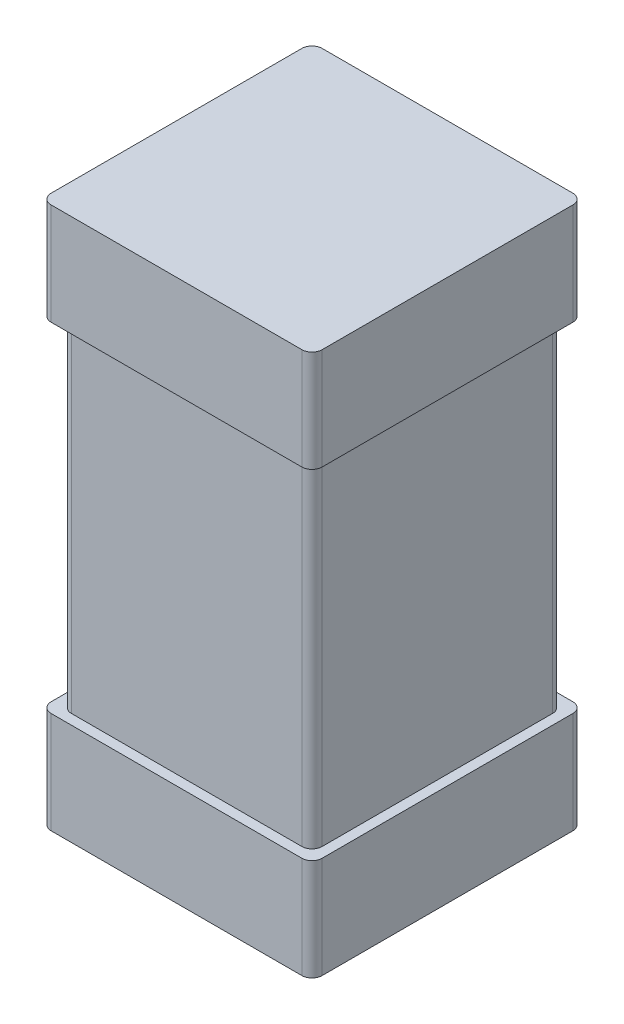
ISO-10303-21;
HEADER;
FILE_DESCRIPTION(('STEP AP214'),'2;1');
FILE_NAME('part.step','',(''),(''),'','','');
FILE_SCHEMA(('AUTOMOTIVE_DESIGN { 1 0 10303 214 1 1 1 1 }'));
ENDSEC;
DATA;
#1=APPLICATION_CONTEXT('core data for automotive mechanical design processes');
#2=APPLICATION_PROTOCOL_DEFINITION('international standard','automotive_design',2000,#1);
#3=PRODUCT_CONTEXT('',#1,'mechanical');
#4=PRODUCT('Part','Part','',(#3));
#5=PRODUCT_RELATED_PRODUCT_CATEGORY('part','',(#4));
#6=PRODUCT_DEFINITION_FORMATION('','',#4);
#7=PRODUCT_DEFINITION_CONTEXT('part definition',#1,'design');
#8=PRODUCT_DEFINITION('design','',#6,#7);
#9=PRODUCT_DEFINITION_SHAPE('','',#8);
#10=(LENGTH_UNIT() NAMED_UNIT(*) SI_UNIT(.MILLI.,.METRE.));
#11=(NAMED_UNIT(*) PLANE_ANGLE_UNIT() SI_UNIT($,.RADIAN.));
#12=(NAMED_UNIT(*) SI_UNIT($,.STERADIAN.) SOLID_ANGLE_UNIT());
#13=UNCERTAINTY_MEASURE_WITH_UNIT(LENGTH_MEASURE(1.E-05),#10,'distance_accuracy_value','');
#14=(GEOMETRIC_REPRESENTATION_CONTEXT(3) GLOBAL_UNCERTAINTY_ASSIGNED_CONTEXT((#13)) GLOBAL_UNIT_ASSIGNED_CONTEXT((#10,
#11,#12)) REPRESENTATION_CONTEXT('',''));
#15=CARTESIAN_POINT('',(0.,0.,0.));
#16=DIRECTION('',(0.,0.,1.));
#17=DIRECTION('',(1.,0.,0.));
#18=AXIS2_PLACEMENT_3D('',#15,#16,#17);
#19=CARTESIAN_POINT('',(184.843744279938,101.58204329235,112.211582908599));
#20=DIRECTION('',(0.,1.,0.));
#21=DIRECTION('',(1.,0.,0.));
#22=AXIS2_PLACEMENT_3D('',#19,#20,#21);
#23=PLANE('',#22);
#24=DIRECTION('',(0.,0.,1.));
#25=VECTOR('',#24,1.);
#26=CARTESIAN_POINT('',(184.843744279938,101.58204329235,112.211582908599));
#27=LINE('',#26,#25);
#28=CARTESIAN_POINT('',(184.843744279938,101.58204329235,112.241582908599));
#29=VERTEX_POINT('',#28);
#30=CARTESIAN_POINT('',(184.843744279938,101.58204329235,112.981582908599));
#31=VERTEX_POINT('',#30);
#32=EDGE_CURVE('E67',#29,#31,#27,.T.);
#33=ORIENTED_EDGE('',*,*,#32,.F.);
#34=CARTESIAN_POINT('',(184.813744279938,101.58204329235,112.241582908599));
#35=DIRECTION('',(0.,1.,0.));
#36=DIRECTION('',(0.,0.,1.));
#37=AXIS2_PLACEMENT_3D('',#34,#35,#36);
#38=CIRCLE('',#37,0.0300000000000023);
#39=CARTESIAN_POINT('',(184.813744279938,101.58204329235,112.211582908599));
#40=VERTEX_POINT('',#39);
#41=EDGE_CURVE('E11',#29,#40,#38,.T.);
#42=ORIENTED_EDGE('',*,*,#41,.T.);
#43=DIRECTION('',(-1.,0.,0.));
#44=VECTOR('',#43,1.);
#45=CARTESIAN_POINT('',(184.843744279938,101.58204329235,112.211582908599));
#46=LINE('',#45,#44);
#47=CARTESIAN_POINT('',(184.073744279938,101.58204329235,112.211582908599));
#48=VERTEX_POINT('',#47);
#49=EDGE_CURVE('E55',#40,#48,#46,.T.);
#50=ORIENTED_EDGE('',*,*,#49,.T.);
#51=CARTESIAN_POINT('',(184.073744279938,101.58204329235,112.241582908599));
#52=DIRECTION('',(0.,-1.,0.));
#53=DIRECTION('',(0.,0.,1.));
#54=AXIS2_PLACEMENT_3D('',#51,#52,#53);
#55=CIRCLE('',#54,0.0300000000000023);
#56=CARTESIAN_POINT('',(184.043744279938,101.58204329235,112.241582908599));
#57=VERTEX_POINT('',#56);
#58=EDGE_CURVE('E107',#57,#48,#55,.T.);
#59=ORIENTED_EDGE('',*,*,#58,.F.);
#60=DIRECTION('',(0.,0.,1.));
#61=VECTOR('',#60,1.);
#62=CARTESIAN_POINT('',(184.043744279938,101.58204329235,112.211582908599));
#63=LINE('',#62,#61);
#64=CARTESIAN_POINT('',(184.043744279938,101.58204329235,112.981582908599));
#65=VERTEX_POINT('',#64);
#66=EDGE_CURVE('E393',#57,#65,#63,.T.);
#67=ORIENTED_EDGE('',*,*,#66,.T.);
#68=CARTESIAN_POINT('',(184.073744279938,101.58204329235,112.981582908599));
#69=DIRECTION('',(0.,1.,0.));
#70=DIRECTION('',(0.,0.,1.));
#71=AXIS2_PLACEMENT_3D('',#68,#69,#70);
#72=CIRCLE('',#71,0.0300000000000023);
#73=CARTESIAN_POINT('',(184.073744279938,101.58204329235,113.011582908599));
#74=VERTEX_POINT('',#73);
#75=EDGE_CURVE('E122',#65,#74,#72,.T.);
#76=ORIENTED_EDGE('',*,*,#75,.T.);
#77=DIRECTION('',(-1.,0.,0.));
#78=VECTOR('',#77,1.);
#79=CARTESIAN_POINT('',(184.843744279938,101.58204329235,113.011582908599));
#80=LINE('',#79,#78);
#81=CARTESIAN_POINT('',(184.813744279938,101.58204329235,113.011582908599));
#82=VERTEX_POINT('',#81);
#83=EDGE_CURVE('E447',#82,#74,#80,.T.);
#84=ORIENTED_EDGE('',*,*,#83,.F.);
#85=CARTESIAN_POINT('',(184.813744279938,101.58204329235,112.981582908599));
#86=DIRECTION('',(0.,-1.,0.));
#87=DIRECTION('',(0.,0.,1.));
#88=AXIS2_PLACEMENT_3D('',#85,#86,#87);
#89=CIRCLE('',#88,0.0300000000000023);
#90=EDGE_CURVE('E394',#31,#82,#89,.T.);
#91=ORIENTED_EDGE('',*,*,#90,.F.);
#92=EDGE_LOOP('',(#33,#42,#50,#59,#67,#76,#84,#91));
#93=FACE_BOUND('',#92,.T.);
#94=ADVANCED_FACE('F44',(#93),#23,.T.);
#95=CARTESIAN_POINT('',(184.043744279938,101.28204329235,112.211582908599));
#96=DIRECTION('',(-1.,0.,0.));
#97=DIRECTION('',(0.,0.,1.));
#98=AXIS2_PLACEMENT_3D('',#95,#96,#97);
#99=PLANE('',#98);
#100=ORIENTED_EDGE('',*,*,#66,.F.);
#101=DIRECTION('',(0.,1.,0.));
#102=VECTOR('',#101,1.);
#103=CARTESIAN_POINT('',(184.043744279938,101.28204329235,112.241582908599));
#104=LINE('',#103,#102);
#105=CARTESIAN_POINT('',(184.043744279938,101.28204329235,112.241582908599));
#106=VERTEX_POINT('',#105);
#107=EDGE_CURVE('E296',#106,#57,#104,.T.);
#108=ORIENTED_EDGE('',*,*,#107,.F.);
#109=DIRECTION('',(0.,0.,1.));
#110=VECTOR('',#109,1.);
#111=CARTESIAN_POINT('',(184.043744279938,101.28204329235,112.211582908599));
#112=LINE('',#111,#110);
#113=CARTESIAN_POINT('',(184.043744279938,101.28204329235,112.981582908599));
#114=VERTEX_POINT('',#113);
#115=EDGE_CURVE('E319',#106,#114,#112,.T.);
#116=ORIENTED_EDGE('',*,*,#115,.T.);
#117=DIRECTION('',(0.,1.,0.));
#118=VECTOR('',#117,1.);
#119=CARTESIAN_POINT('',(184.043744279938,101.28204329235,112.981582908599));
#120=LINE('',#119,#118);
#121=EDGE_CURVE('E323',#114,#65,#120,.T.);
#122=ORIENTED_EDGE('',*,*,#121,.T.);
#123=EDGE_LOOP('',(#100,#108,#116,#122));
#124=FACE_BOUND('',#123,.T.);
#125=ADVANCED_FACE('F708',(#124),#99,.T.);
#126=CARTESIAN_POINT('',(184.073744279938,101.28204329235,112.981582908599));
#127=DIRECTION('',(0.,1.,0.));
#128=DIRECTION('',(-1.,0.,0.));
#129=AXIS2_PLACEMENT_3D('',#126,#127,#128);
#130=CYLINDRICAL_SURFACE('',#129,0.0300000000000023);
#131=CARTESIAN_POINT('',(184.073744279938,101.28204329235,112.981582908599));
#132=DIRECTION('',(0.,1.,0.));
#133=DIRECTION('',(0.,0.,1.));
#134=AXIS2_PLACEMENT_3D('',#131,#132,#133);
#135=CIRCLE('',#134,0.0300000000000023);
#136=CARTESIAN_POINT('',(184.073744279938,101.28204329235,113.011582908599));
#137=VERTEX_POINT('',#136);
#138=EDGE_CURVE('E348',#114,#137,#135,.T.);
#139=ORIENTED_EDGE('',*,*,#138,.T.);
#140=DIRECTION('',(0.,1.,0.));
#141=VECTOR('',#140,1.);
#142=CARTESIAN_POINT('',(184.073744279938,101.28204329235,113.011582908599));
#143=LINE('',#142,#141);
#144=EDGE_CURVE('E300',#137,#74,#143,.T.);
#145=ORIENTED_EDGE('',*,*,#144,.T.);
#146=ORIENTED_EDGE('',*,*,#75,.F.);
#147=ORIENTED_EDGE('',*,*,#121,.F.);
#148=EDGE_LOOP('',(#139,#145,#146,#147));
#149=FACE_BOUND('',#148,.T.);
#150=ADVANCED_FACE('F586',(#149),#130,.T.);
#151=CARTESIAN_POINT('',(184.073744279938,101.28204329235,112.241582908599));
#152=DIRECTION('',(0.,1.,0.));
#153=DIRECTION('',(-1.,0.,0.));
#154=AXIS2_PLACEMENT_3D('',#151,#152,#153);
#155=CYLINDRICAL_SURFACE('',#154,0.0300000000000023);
#156=ORIENTED_EDGE('',*,*,#107,.T.);
#157=ORIENTED_EDGE('',*,*,#58,.T.);
#158=DIRECTION('',(0.,1.,0.));
#159=VECTOR('',#158,1.);
#160=CARTESIAN_POINT('',(184.073744279938,101.28204329235,112.211582908599));
#161=LINE('',#160,#159);
#162=CARTESIAN_POINT('',(184.073744279938,101.28204329235,112.211582908599));
#163=VERTEX_POINT('',#162);
#164=EDGE_CURVE('E471',#163,#48,#161,.T.);
#165=ORIENTED_EDGE('',*,*,#164,.F.);
#166=CARTESIAN_POINT('',(184.073744279938,101.28204329235,112.241582908599));
#167=DIRECTION('',(0.,-1.,0.));
#168=DIRECTION('',(0.,0.,1.));
#169=AXIS2_PLACEMENT_3D('',#166,#167,#168);
#170=CIRCLE('',#169,0.0300000000000023);
#171=EDGE_CURVE('E312',#106,#163,#170,.T.);
#172=ORIENTED_EDGE('',*,*,#171,.F.);
#173=EDGE_LOOP('',(#156,#157,#165,#172));
#174=FACE_BOUND('',#173,.T.);
#175=ADVANCED_FACE('F507',(#174),#155,.T.);
#176=CARTESIAN_POINT('',(184.843744279938,101.28204329235,113.011582908599));
#177=DIRECTION('',(0.,0.,1.));
#178=DIRECTION('',(1.,0.,0.));
#179=AXIS2_PLACEMENT_3D('',#176,#177,#178);
#180=PLANE('',#179);
#181=DIRECTION('',(-1.,0.,0.));
#182=VECTOR('',#181,1.);
#183=CARTESIAN_POINT('',(184.843744279938,101.28204329235,113.011582908599));
#184=LINE('',#183,#182);
#185=CARTESIAN_POINT('',(184.813744279938,101.28204329235,113.011582908599));
#186=VERTEX_POINT('',#185);
#187=EDGE_CURVE('E307',#186,#137,#184,.T.);
#188=ORIENTED_EDGE('',*,*,#187,.F.);
#189=DIRECTION('',(0.,1.,0.));
#190=VECTOR('',#189,1.);
#191=CARTESIAN_POINT('',(184.813744279938,101.28204329235,113.011582908599));
#192=LINE('',#191,#190);
#193=EDGE_CURVE('E443',#186,#82,#192,.T.);
#194=ORIENTED_EDGE('',*,*,#193,.T.);
#195=ORIENTED_EDGE('',*,*,#83,.T.);
#196=ORIENTED_EDGE('',*,*,#144,.F.);
#197=EDGE_LOOP('',(#188,#194,#195,#196));
#198=FACE_BOUND('',#197,.T.);
#199=ADVANCED_FACE('F584',(#198),#180,.T.);
#200=CARTESIAN_POINT('',(184.843744279938,101.28204329235,112.211582908599));
#201=DIRECTION('',(0.,0.,1.));
#202=DIRECTION('',(1.,0.,0.));
#203=AXIS2_PLACEMENT_3D('',#200,#201,#202);
#204=PLANE('',#203);
#205=ORIENTED_EDGE('',*,*,#164,.T.);
#206=ORIENTED_EDGE('',*,*,#49,.F.);
#207=DIRECTION('',(0.,1.,0.));
#208=VECTOR('',#207,1.);
#209=CARTESIAN_POINT('',(184.813744279938,101.28204329235,112.211582908599));
#210=LINE('',#209,#208);
#211=CARTESIAN_POINT('',(184.813744279938,101.28204329235,112.211582908599));
#212=VERTEX_POINT('',#211);
#213=EDGE_CURVE('E385',#212,#40,#210,.T.);
#214=ORIENTED_EDGE('',*,*,#213,.F.);
#215=DIRECTION('',(-1.,0.,0.));
#216=VECTOR('',#215,1.);
#217=CARTESIAN_POINT('',(184.843744279938,101.28204329235,112.211582908599));
#218=LINE('',#217,#216);
#219=EDGE_CURVE('E475',#212,#163,#218,.T.);
#220=ORIENTED_EDGE('',*,*,#219,.T.);
#221=EDGE_LOOP('',(#205,#206,#214,#220));
#222=FACE_BOUND('',#221,.T.);
#223=ADVANCED_FACE('F509',(#222),#204,.F.);
#224=CARTESIAN_POINT('',(184.813744279938,101.28204329235,112.981582908599));
#225=DIRECTION('',(0.,1.,0.));
#226=DIRECTION('',(1.,0.,0.));
#227=AXIS2_PLACEMENT_3D('',#224,#225,#226);
#228=CYLINDRICAL_SURFACE('',#227,0.0300000000000023);
#229=DIRECTION('',(0.,1.,0.));
#230=VECTOR('',#229,1.);
#231=CARTESIAN_POINT('',(184.843744279938,101.28204329235,112.981582908599));
#232=LINE('',#231,#230);
#233=CARTESIAN_POINT('',(184.843744279938,101.28204329235,112.981582908599));
#234=VERTEX_POINT('',#233);
#235=EDGE_CURVE('E398',#234,#31,#232,.T.);
#236=ORIENTED_EDGE('',*,*,#235,.T.);
#237=ORIENTED_EDGE('',*,*,#90,.T.);
#238=ORIENTED_EDGE('',*,*,#193,.F.);
#239=CARTESIAN_POINT('',(184.813744279938,101.28204329235,112.981582908599));
#240=DIRECTION('',(0.,-1.,0.));
#241=DIRECTION('',(0.,0.,1.));
#242=AXIS2_PLACEMENT_3D('',#239,#240,#241);
#243=CIRCLE('',#242,0.0300000000000023);
#244=EDGE_CURVE('E311',#234,#186,#243,.T.);
#245=ORIENTED_EDGE('',*,*,#244,.F.);
#246=EDGE_LOOP('',(#236,#237,#238,#245));
#247=FACE_BOUND('',#246,.T.);
#248=ADVANCED_FACE('F588',(#247),#228,.T.);
#249=CARTESIAN_POINT('',(184.813744279938,101.28204329235,112.241582908599));
#250=DIRECTION('',(0.,1.,0.));
#251=DIRECTION('',(1.,0.,0.));
#252=AXIS2_PLACEMENT_3D('',#249,#250,#251);
#253=CYLINDRICAL_SURFACE('',#252,0.0300000000000023);
#254=CARTESIAN_POINT('',(184.813744279938,101.28204329235,112.241582908599));
#255=DIRECTION('',(0.,1.,0.));
#256=DIRECTION('',(0.,0.,1.));
#257=AXIS2_PLACEMENT_3D('',#254,#255,#256);
#258=CIRCLE('',#257,0.0300000000000023);
#259=CARTESIAN_POINT('',(184.843744279938,101.28204329235,112.241582908599));
#260=VERTEX_POINT('',#259);
#261=EDGE_CURVE('E389',#260,#212,#258,.T.);
#262=ORIENTED_EDGE('',*,*,#261,.T.);
#263=ORIENTED_EDGE('',*,*,#213,.T.);
#264=ORIENTED_EDGE('',*,*,#41,.F.);
#265=DIRECTION('',(0.,1.,0.));
#266=VECTOR('',#265,1.);
#267=CARTESIAN_POINT('',(184.843744279938,101.28204329235,112.241582908599));
#268=LINE('',#267,#266);
#269=EDGE_CURVE('E390',#260,#29,#268,.T.);
#270=ORIENTED_EDGE('',*,*,#269,.F.);
#271=EDGE_LOOP('',(#262,#263,#264,#270));
#272=FACE_BOUND('',#271,.T.);
#273=ADVANCED_FACE('F511',(#272),#253,.T.);
#274=CARTESIAN_POINT('',(184.843744279938,101.28204329235,112.211582908599));
#275=DIRECTION('',(-1.,0.,0.));
#276=DIRECTION('',(0.,0.,1.));
#277=AXIS2_PLACEMENT_3D('',#274,#275,#276);
#278=PLANE('',#277);
#279=ORIENTED_EDGE('',*,*,#235,.F.);
#280=DIRECTION('',(0.,0.,1.));
#281=VECTOR('',#280,1.);
#282=CARTESIAN_POINT('',(184.843744279938,101.28204329235,112.211582908599));
#283=LINE('',#282,#281);
#284=EDGE_CURVE('E404',#260,#234,#283,.T.);
#285=ORIENTED_EDGE('',*,*,#284,.F.);
#286=ORIENTED_EDGE('',*,*,#269,.T.);
#287=ORIENTED_EDGE('',*,*,#32,.T.);
#288=EDGE_LOOP('',(#279,#285,#286,#287));
#289=FACE_BOUND('',#288,.T.);
#290=ADVANCED_FACE('F719',(#289),#278,.F.);
#291=CARTESIAN_POINT('',(184.843744279938,101.28204329235,112.211582908599));
#292=DIRECTION('',(0.,1.,0.));
#293=DIRECTION('',(1.,0.,0.));
#294=AXIS2_PLACEMENT_3D('',#291,#292,#293);
#295=PLANE('',#294);
#296=ORIENTED_EDGE('',*,*,#244,.T.);
#297=ORIENTED_EDGE('',*,*,#187,.T.);
#298=ORIENTED_EDGE('',*,*,#138,.F.);
#299=ORIENTED_EDGE('',*,*,#115,.F.);
#300=ORIENTED_EDGE('',*,*,#171,.T.);
#301=ORIENTED_EDGE('',*,*,#219,.F.);
#302=ORIENTED_EDGE('',*,*,#261,.F.);
#303=ORIENTED_EDGE('',*,*,#284,.T.);
#304=EDGE_LOOP('',(#296,#297,#298,#299,#300,#301,#302,#303));
#305=FACE_BOUND('',#304,.T.);
#306=DIRECTION('',(-1.,0.,0.));
#307=VECTOR('',#306,1.);
#308=CARTESIAN_POINT('',(184.813744279938,101.28204329235,112.241582908599));
#309=LINE('',#308,#307);
#310=CARTESIAN_POINT('',(184.783744279938,101.28204329235,112.241582908599));
#311=VERTEX_POINT('',#310);
#312=CARTESIAN_POINT('',(184.103744279938,101.28204329235,112.241582908599));
#313=VERTEX_POINT('',#312);
#314=EDGE_CURVE('E362',#311,#313,#309,.T.);
#315=ORIENTED_EDGE('',*,*,#314,.T.);
#316=CARTESIAN_POINT('',(184.103744279938,101.28204329235,112.271582908599));
#317=DIRECTION('',(0.,-1.,0.));
#318=DIRECTION('',(0.,0.,1.));
#319=AXIS2_PLACEMENT_3D('',#316,#317,#318);
#320=CIRCLE('',#319,0.0300000000000023);
#321=CARTESIAN_POINT('',(184.073744279938,101.28204329235,112.271582908599));
#322=VERTEX_POINT('',#321);
#323=EDGE_CURVE('E327',#322,#313,#320,.T.);
#324=ORIENTED_EDGE('',*,*,#323,.F.);
#325=DIRECTION('',(0.,0.,1.));
#326=VECTOR('',#325,1.);
#327=CARTESIAN_POINT('',(184.073744279938,101.28204329235,112.241582908599));
#328=LINE('',#327,#326);
#329=CARTESIAN_POINT('',(184.073744279938,101.28204329235,112.951582908599));
#330=VERTEX_POINT('',#329);
#331=EDGE_CURVE('E358',#322,#330,#328,.T.);
#332=ORIENTED_EDGE('',*,*,#331,.T.);
#333=CARTESIAN_POINT('',(184.103744279938,101.28204329235,112.951582908599));
#334=DIRECTION('',(0.,1.,0.));
#335=DIRECTION('',(0.,0.,1.));
#336=AXIS2_PLACEMENT_3D('',#333,#334,#335);
#337=CIRCLE('',#336,0.0300000000000023);
#338=CARTESIAN_POINT('',(184.103744279938,101.28204329235,112.981582908599));
#339=VERTEX_POINT('',#338);
#340=EDGE_CURVE('E363',#330,#339,#337,.T.);
#341=ORIENTED_EDGE('',*,*,#340,.T.);
#342=DIRECTION('',(-1.,0.,0.));
#343=VECTOR('',#342,1.);
#344=CARTESIAN_POINT('',(184.813744279938,101.28204329235,112.981582908599));
#345=LINE('',#344,#343);
#346=CARTESIAN_POINT('',(184.783744279938,101.28204329235,112.981582908599));
#347=VERTEX_POINT('',#346);
#348=EDGE_CURVE('E345',#347,#339,#345,.T.);
#349=ORIENTED_EDGE('',*,*,#348,.F.);
#350=CARTESIAN_POINT('',(184.783744279938,101.28204329235,112.951582908599));
#351=DIRECTION('',(0.,-1.,0.));
#352=DIRECTION('',(0.,0.,1.));
#353=AXIS2_PLACEMENT_3D('',#350,#351,#352);
#354=CIRCLE('',#353,0.0300000000000023);
#355=CARTESIAN_POINT('',(184.813744279938,101.28204329235,112.951582908599));
#356=VERTEX_POINT('',#355);
#357=EDGE_CURVE('E318',#356,#347,#354,.T.);
#358=ORIENTED_EDGE('',*,*,#357,.F.);
#359=DIRECTION('',(0.,0.,1.));
#360=VECTOR('',#359,1.);
#361=CARTESIAN_POINT('',(184.813744279938,101.28204329235,112.241582908599));
#362=LINE('',#361,#360);
#363=CARTESIAN_POINT('',(184.813744279938,101.28204329235,112.271582908599));
#364=VERTEX_POINT('',#363);
#365=EDGE_CURVE('E317',#364,#356,#362,.T.);
#366=ORIENTED_EDGE('',*,*,#365,.F.);
#367=CARTESIAN_POINT('',(184.783744279938,101.28204329235,112.271582908599));
#368=DIRECTION('',(0.,1.,0.));
#369=DIRECTION('',(0.,0.,1.));
#370=AXIS2_PLACEMENT_3D('',#367,#368,#369);
#371=CIRCLE('',#370,0.0300000000000023);
#372=EDGE_CURVE('E408',#364,#311,#371,.T.);
#373=ORIENTED_EDGE('',*,*,#372,.T.);
#374=EDGE_LOOP('',(#315,#324,#332,#341,#349,#358,#366,#373));
#375=FACE_BOUND('',#374,.T.);
#376=ADVANCED_FACE('F501',(#305,#375),#295,.F.);
#377=CARTESIAN_POINT('',(184.813744279938,100.28204329235,112.241582908599));
#378=DIRECTION('',(-1.,0.,0.));
#379=DIRECTION('',(0.,0.,1.));
#380=AXIS2_PLACEMENT_3D('',#377,#378,#379);
#381=PLANE('',#380);
#382=DIRECTION('',(0.,1.,0.));
#383=VECTOR('',#382,1.);
#384=CARTESIAN_POINT('',(184.813744279938,100.28204329235,112.951582908599));
#385=LINE('',#384,#383);
#386=CARTESIAN_POINT('',(184.813744279938,100.28204329235,112.951582908599));
#387=VERTEX_POINT('',#386);
#388=EDGE_CURVE('E313',#387,#356,#385,.T.);
#389=ORIENTED_EDGE('',*,*,#388,.F.);
#390=DIRECTION('',(0.,0.,1.));
#391=VECTOR('',#390,1.);
#392=CARTESIAN_POINT('',(184.813744279938,100.28204329235,112.241582908599));
#393=LINE('',#392,#391);
#394=CARTESIAN_POINT('',(184.813744279938,100.28204329235,112.271582908599));
#395=VERTEX_POINT('',#394);
#396=EDGE_CURVE('E331',#395,#387,#393,.T.);
#397=ORIENTED_EDGE('',*,*,#396,.F.);
#398=DIRECTION('',(0.,1.,0.));
#399=VECTOR('',#398,1.);
#400=CARTESIAN_POINT('',(184.813744279938,100.28204329235,112.271582908599));
#401=LINE('',#400,#399);
#402=EDGE_CURVE('E437',#395,#364,#401,.T.);
#403=ORIENTED_EDGE('',*,*,#402,.T.);
#404=ORIENTED_EDGE('',*,*,#365,.T.);
#405=EDGE_LOOP('',(#389,#397,#403,#404));
#406=FACE_BOUND('',#405,.T.);
#407=ADVANCED_FACE('F693',(#406),#381,.F.);
#408=CARTESIAN_POINT('',(184.783744279938,100.28204329235,112.951582908599));
#409=DIRECTION('',(0.,1.,0.));
#410=DIRECTION('',(1.,0.,0.));
#411=AXIS2_PLACEMENT_3D('',#408,#409,#410);
#412=CYLINDRICAL_SURFACE('',#411,0.0300000000000023);
#413=ORIENTED_EDGE('',*,*,#388,.T.);
#414=ORIENTED_EDGE('',*,*,#357,.T.);
#415=DIRECTION('',(0.,1.,0.));
#416=VECTOR('',#415,1.);
#417=CARTESIAN_POINT('',(184.783744279938,100.28204329235,112.981582908599));
#418=LINE('',#417,#416);
#419=CARTESIAN_POINT('',(184.783744279938,100.28204329235,112.981582908599));
#420=VERTEX_POINT('',#419);
#421=EDGE_CURVE('E376',#420,#347,#418,.T.);
#422=ORIENTED_EDGE('',*,*,#421,.F.);
#423=CARTESIAN_POINT('',(184.783744279938,100.28204329235,112.951582908599));
#424=DIRECTION('',(0.,-1.,0.));
#425=DIRECTION('',(0.,0.,1.));
#426=AXIS2_PLACEMENT_3D('',#423,#424,#425);
#427=CIRCLE('',#426,0.0300000000000023);
#428=EDGE_CURVE('E328',#387,#420,#427,.T.);
#429=ORIENTED_EDGE('',*,*,#428,.F.);
#430=EDGE_LOOP('',(#413,#414,#422,#429));
#431=FACE_BOUND('',#430,.T.);
#432=ADVANCED_FACE('F697',(#431),#412,.T.);
#433=CARTESIAN_POINT('',(184.813744279938,100.28204329235,112.981582908599));
#434=DIRECTION('',(0.,0.,1.));
#435=DIRECTION('',(1.,0.,0.));
#436=AXIS2_PLACEMENT_3D('',#433,#434,#435);
#437=PLANE('',#436);
#438=DIRECTION('',(-1.,0.,0.));
#439=VECTOR('',#438,1.);
#440=CARTESIAN_POINT('',(184.813744279938,100.28204329235,112.981582908599));
#441=LINE('',#440,#439);
#442=CARTESIAN_POINT('',(184.103744279938,100.28204329235,112.981582908599));
#443=VERTEX_POINT('',#442);
#444=EDGE_CURVE('E332',#420,#443,#441,.T.);
#445=ORIENTED_EDGE('',*,*,#444,.F.);
#446=ORIENTED_EDGE('',*,*,#421,.T.);
#447=ORIENTED_EDGE('',*,*,#348,.T.);
#448=DIRECTION('',(0.,1.,0.));
#449=VECTOR('',#448,1.);
#450=CARTESIAN_POINT('',(184.103744279938,100.28204329235,112.981582908599));
#451=LINE('',#450,#449);
#452=EDGE_CURVE('E346',#443,#339,#451,.T.);
#453=ORIENTED_EDGE('',*,*,#452,.F.);
#454=EDGE_LOOP('',(#445,#446,#447,#453));
#455=FACE_BOUND('',#454,.T.);
#456=ADVANCED_FACE('F597',(#455),#437,.T.);
#457=CARTESIAN_POINT('',(184.103744279938,100.28204329235,112.951582908599));
#458=DIRECTION('',(0.,1.,0.));
#459=DIRECTION('',(-1.,0.,0.));
#460=AXIS2_PLACEMENT_3D('',#457,#458,#459);
#461=CYLINDRICAL_SURFACE('',#460,0.0300000000000023);
#462=CARTESIAN_POINT('',(184.103744279938,100.28204329235,112.951582908599));
#463=DIRECTION('',(0.,1.,0.));
#464=DIRECTION('',(0.,0.,1.));
#465=AXIS2_PLACEMENT_3D('',#462,#463,#464);
#466=CIRCLE('',#465,0.0300000000000023);
#467=CARTESIAN_POINT('',(184.073744279938,100.28204329235,112.951582908599));
#468=VERTEX_POINT('',#467);
#469=EDGE_CURVE('E342',#468,#443,#466,.T.);
#470=ORIENTED_EDGE('',*,*,#469,.T.);
#471=ORIENTED_EDGE('',*,*,#452,.T.);
#472=ORIENTED_EDGE('',*,*,#340,.F.);
#473=DIRECTION('',(0.,1.,0.));
#474=VECTOR('',#473,1.);
#475=CARTESIAN_POINT('',(184.073744279938,100.28204329235,112.951582908599));
#476=LINE('',#475,#474);
#477=EDGE_CURVE('E301',#468,#330,#476,.T.);
#478=ORIENTED_EDGE('',*,*,#477,.F.);
#479=EDGE_LOOP('',(#470,#471,#472,#478));
#480=FACE_BOUND('',#479,.T.);
#481=ADVANCED_FACE('F46',(#480),#461,.T.);
#482=CARTESIAN_POINT('',(184.073744279938,100.28204329235,112.241582908599));
#483=DIRECTION('',(-1.,0.,0.));
#484=DIRECTION('',(0.,0.,1.));
#485=AXIS2_PLACEMENT_3D('',#482,#483,#484);
#486=PLANE('',#485);
#487=ORIENTED_EDGE('',*,*,#331,.F.);
#488=DIRECTION('',(0.,1.,0.));
#489=VECTOR('',#488,1.);
#490=CARTESIAN_POINT('',(184.073744279938,100.28204329235,112.271582908599));
#491=LINE('',#490,#489);
#492=CARTESIAN_POINT('',(184.073744279938,100.28204329235,112.271582908599));
#493=VERTEX_POINT('',#492);
#494=EDGE_CURVE('E306',#493,#322,#491,.T.);
#495=ORIENTED_EDGE('',*,*,#494,.F.);
#496=DIRECTION('',(0.,0.,1.));
#497=VECTOR('',#496,1.);
#498=CARTESIAN_POINT('',(184.073744279938,100.28204329235,112.241582908599));
#499=LINE('',#498,#497);
#500=EDGE_CURVE('E305',#493,#468,#499,.T.);
#501=ORIENTED_EDGE('',*,*,#500,.T.);
#502=ORIENTED_EDGE('',*,*,#477,.T.);
#503=EDGE_LOOP('',(#487,#495,#501,#502));
#504=FACE_BOUND('',#503,.T.);
#505=ADVANCED_FACE('F572',(#504),#486,.T.);
#506=CARTESIAN_POINT('',(184.103744279938,100.28204329235,112.271582908599));
#507=DIRECTION('',(0.,1.,0.));
#508=DIRECTION('',(-1.,0.,0.));
#509=AXIS2_PLACEMENT_3D('',#506,#507,#508);
#510=CYLINDRICAL_SURFACE('',#509,0.0300000000000023);
#511=ORIENTED_EDGE('',*,*,#494,.T.);
#512=ORIENTED_EDGE('',*,*,#323,.T.);
#513=DIRECTION('',(0.,1.,0.));
#514=VECTOR('',#513,1.);
#515=CARTESIAN_POINT('',(184.103744279938,100.28204329235,112.241582908599));
#516=LINE('',#515,#514);
#517=CARTESIAN_POINT('',(184.103744279938,100.28204329235,112.241582908599));
#518=VERTEX_POINT('',#517);
#519=EDGE_CURVE('E426',#518,#313,#516,.T.);
#520=ORIENTED_EDGE('',*,*,#519,.F.);
#521=CARTESIAN_POINT('',(184.103744279938,100.28204329235,112.271582908599));
#522=DIRECTION('',(0.,-1.,0.));
#523=DIRECTION('',(0.,0.,1.));
#524=AXIS2_PLACEMENT_3D('',#521,#522,#523);
#525=CIRCLE('',#524,0.0300000000000023);
#526=EDGE_CURVE('E355',#493,#518,#525,.T.);
#527=ORIENTED_EDGE('',*,*,#526,.F.);
#528=EDGE_LOOP('',(#511,#512,#520,#527));
#529=FACE_BOUND('',#528,.T.);
#530=ADVANCED_FACE('F548',(#529),#510,.T.);
#531=CARTESIAN_POINT('',(184.813744279938,100.28204329235,112.241582908599));
#532=DIRECTION('',(0.,0.,1.));
#533=DIRECTION('',(1.,0.,0.));
#534=AXIS2_PLACEMENT_3D('',#531,#532,#533);
#535=PLANE('',#534);
#536=ORIENTED_EDGE('',*,*,#519,.T.);
#537=ORIENTED_EDGE('',*,*,#314,.F.);
#538=DIRECTION('',(0.,1.,0.));
#539=VECTOR('',#538,1.);
#540=CARTESIAN_POINT('',(184.783744279938,100.28204329235,112.241582908599));
#541=LINE('',#540,#539);
#542=CARTESIAN_POINT('',(184.783744279938,100.28204329235,112.241582908599));
#543=VERTEX_POINT('',#542);
#544=EDGE_CURVE('E372',#543,#311,#541,.T.);
#545=ORIENTED_EDGE('',*,*,#544,.F.);
#546=DIRECTION('',(-1.,0.,0.));
#547=VECTOR('',#546,1.);
#548=CARTESIAN_POINT('',(184.813744279938,100.28204329235,112.241582908599));
#549=LINE('',#548,#547);
#550=EDGE_CURVE('E287',#543,#518,#549,.T.);
#551=ORIENTED_EDGE('',*,*,#550,.T.);
#552=EDGE_LOOP('',(#536,#537,#545,#551));
#553=FACE_BOUND('',#552,.T.);
#554=ADVANCED_FACE('F539',(#553),#535,.F.);
#555=CARTESIAN_POINT('',(184.783744279938,100.28204329235,112.271582908599));
#556=DIRECTION('',(0.,1.,0.));
#557=DIRECTION('',(1.,0.,0.));
#558=AXIS2_PLACEMENT_3D('',#555,#556,#557);
#559=CYLINDRICAL_SURFACE('',#558,0.0300000000000023);
#560=CARTESIAN_POINT('',(184.783744279938,100.28204329235,112.271582908599));
#561=DIRECTION('',(0.,1.,0.));
#562=DIRECTION('',(0.,0.,1.));
#563=AXIS2_PLACEMENT_3D('',#560,#561,#562);
#564=CIRCLE('',#563,0.0300000000000023);
#565=EDGE_CURVE('E368',#395,#543,#564,.T.);
#566=ORIENTED_EDGE('',*,*,#565,.T.);
#567=ORIENTED_EDGE('',*,*,#544,.T.);
#568=ORIENTED_EDGE('',*,*,#372,.F.);
#569=ORIENTED_EDGE('',*,*,#402,.F.);
#570=EDGE_LOOP('',(#566,#567,#568,#569));
#571=FACE_BOUND('',#570,.T.);
#572=ADVANCED_FACE('F532',(#571),#559,.T.);
#573=CARTESIAN_POINT('',(184.843744279938,100.28204329235,112.211582908599));
#574=DIRECTION('',(0.,1.,0.));
#575=DIRECTION('',(1.,0.,0.));
#576=AXIS2_PLACEMENT_3D('',#573,#574,#575);
#577=PLANE('',#576);
#578=DIRECTION('',(0.,0.,1.));
#579=VECTOR('',#578,1.);
#580=CARTESIAN_POINT('',(184.843744279938,100.28204329235,112.211582908599));
#581=LINE('',#580,#579);
#582=CARTESIAN_POINT('',(184.843744279938,100.28204329235,112.241582908599));
#583=VERTEX_POINT('',#582);
#584=CARTESIAN_POINT('',(184.843744279938,100.28204329235,112.981582908599));
#585=VERTEX_POINT('',#584);
#586=EDGE_CURVE('E295',#583,#585,#581,.T.);
#587=ORIENTED_EDGE('',*,*,#586,.F.);
#588=CARTESIAN_POINT('',(184.813744279938,100.28204329235,112.241582908599));
#589=DIRECTION('',(0.,1.,0.));
#590=DIRECTION('',(0.,0.,1.));
#591=AXIS2_PLACEMENT_3D('',#588,#589,#590);
#592=CIRCLE('',#591,0.0300000000000023);
#593=CARTESIAN_POINT('',(184.813744279938,100.28204329235,112.211582908599));
#594=VERTEX_POINT('',#593);
#595=EDGE_CURVE('E373',#583,#594,#592,.T.);
#596=ORIENTED_EDGE('',*,*,#595,.T.);
#597=DIRECTION('',(-1.,0.,0.));
#598=VECTOR('',#597,1.);
#599=CARTESIAN_POINT('',(184.843744279938,100.28204329235,112.211582908599));
#600=LINE('',#599,#598);
#601=CARTESIAN_POINT('',(184.073744279938,100.28204329235,112.211582908599));
#602=VERTEX_POINT('',#601);
#603=EDGE_CURVE('E244',#594,#602,#600,.T.);
#604=ORIENTED_EDGE('',*,*,#603,.T.);
#605=CARTESIAN_POINT('',(184.073744279938,100.28204329235,112.241582908599));
#606=DIRECTION('',(0.,-1.,0.));
#607=DIRECTION('',(0.,0.,1.));
#608=AXIS2_PLACEMENT_3D('',#605,#606,#607);
#609=CIRCLE('',#608,0.0300000000000023);
#610=CARTESIAN_POINT('',(184.043744279938,100.28204329235,112.241582908599));
#611=VERTEX_POINT('',#610);
#612=EDGE_CURVE('E414',#611,#602,#609,.T.);
#613=ORIENTED_EDGE('',*,*,#612,.F.);
#614=DIRECTION('',(0.,0.,1.));
#615=VECTOR('',#614,1.);
#616=CARTESIAN_POINT('',(184.043744279938,100.28204329235,112.211582908599));
#617=LINE('',#616,#615);
#618=CARTESIAN_POINT('',(184.043744279938,100.28204329235,112.981582908599));
#619=VERTEX_POINT('',#618);
#620=EDGE_CURVE('E380',#611,#619,#617,.T.);
#621=ORIENTED_EDGE('',*,*,#620,.T.);
#622=CARTESIAN_POINT('',(184.073744279938,100.28204329235,112.981582908599));
#623=DIRECTION('',(0.,1.,0.));
#624=DIRECTION('',(0.,0.,1.));
#625=AXIS2_PLACEMENT_3D('',#622,#623,#624);
#626=CIRCLE('',#625,0.0300000000000023);
#627=CARTESIAN_POINT('',(184.073744279938,100.28204329235,113.011582908599));
#628=VERTEX_POINT('',#627);
#629=EDGE_CURVE('E384',#619,#628,#626,.T.);
#630=ORIENTED_EDGE('',*,*,#629,.T.);
#631=DIRECTION('',(-1.,0.,0.));
#632=VECTOR('',#631,1.);
#633=CARTESIAN_POINT('',(184.843744279938,100.28204329235,113.011582908599));
#634=LINE('',#633,#632);
#635=CARTESIAN_POINT('',(184.813744279938,100.28204329235,113.011582908599));
#636=VERTEX_POINT('',#635);
#637=EDGE_CURVE('E364',#636,#628,#634,.T.);
#638=ORIENTED_EDGE('',*,*,#637,.F.);
#639=CARTESIAN_POINT('',(184.813744279938,100.28204329235,112.981582908599));
#640=DIRECTION('',(0.,-1.,0.));
#641=DIRECTION('',(0.,0.,1.));
#642=AXIS2_PLACEMENT_3D('',#639,#640,#641);
#643=CIRCLE('',#642,0.0300000000000023);
#644=EDGE_CURVE('E269',#585,#636,#643,.T.);
#645=ORIENTED_EDGE('',*,*,#644,.F.);
#646=EDGE_LOOP('',(#587,#596,#604,#613,#621,#630,#638,#645));
#647=FACE_BOUND('',#646,.T.);
#648=ORIENTED_EDGE('',*,*,#565,.F.);
#649=ORIENTED_EDGE('',*,*,#396,.T.);
#650=ORIENTED_EDGE('',*,*,#428,.T.);
#651=ORIENTED_EDGE('',*,*,#444,.T.);
#652=ORIENTED_EDGE('',*,*,#469,.F.);
#653=ORIENTED_EDGE('',*,*,#500,.F.);
#654=ORIENTED_EDGE('',*,*,#526,.T.);
#655=ORIENTED_EDGE('',*,*,#550,.F.);
#656=EDGE_LOOP('',(#648,#649,#650,#651,#652,#653,#654,#655));
#657=FACE_BOUND('',#656,.T.);
#658=ADVANCED_FACE('F541',(#647,#657),#577,.T.);
#659=CARTESIAN_POINT('',(184.043744279938,99.9820432923502,112.211582908599));
#660=DIRECTION('',(-1.,0.,0.));
#661=DIRECTION('',(0.,0.,1.));
#662=AXIS2_PLACEMENT_3D('',#659,#660,#661);
#663=PLANE('',#662);
#664=ORIENTED_EDGE('',*,*,#620,.F.);
#665=DIRECTION('',(0.,1.,0.));
#666=VECTOR('',#665,1.);
#667=CARTESIAN_POINT('',(184.043744279938,99.9820432923502,112.241582908599));
#668=LINE('',#667,#666);
#669=CARTESIAN_POINT('',(184.043744279938,99.9820432923502,112.241582908599));
#670=VERTEX_POINT('',#669);
#671=EDGE_CURVE('E417',#670,#611,#668,.T.);
#672=ORIENTED_EDGE('',*,*,#671,.F.);
#673=DIRECTION('',(0.,0.,1.));
#674=VECTOR('',#673,1.);
#675=CARTESIAN_POINT('',(184.043744279938,99.9820432923502,112.211582908599));
#676=LINE('',#675,#674);
#677=CARTESIAN_POINT('',(184.043744279938,99.9820432923502,112.981582908599));
#678=VERTEX_POINT('',#677);
#679=EDGE_CURVE('E340',#670,#678,#676,.T.);
#680=ORIENTED_EDGE('',*,*,#679,.T.);
#681=DIRECTION('',(0.,1.,0.));
#682=VECTOR('',#681,1.);
#683=CARTESIAN_POINT('',(184.043744279938,99.9820432923502,112.981582908599));
#684=LINE('',#683,#682);
#685=EDGE_CURVE('E336',#678,#619,#684,.T.);
#686=ORIENTED_EDGE('',*,*,#685,.T.);
#687=EDGE_LOOP('',(#664,#672,#680,#686));
#688=FACE_BOUND('',#687,.T.);
#689=ADVANCED_FACE('F611',(#688),#663,.T.);
#690=CARTESIAN_POINT('',(184.073744279938,99.9820432923502,112.981582908599));
#691=DIRECTION('',(0.,1.,0.));
#692=DIRECTION('',(-1.,0.,0.));
#693=AXIS2_PLACEMENT_3D('',#690,#691,#692);
#694=CYLINDRICAL_SURFACE('',#693,0.0300000000000023);
#695=CARTESIAN_POINT('',(184.073744279938,99.9820432923502,112.981582908599));
#696=DIRECTION('',(0.,1.,0.));
#697=DIRECTION('',(0.,0.,1.));
#698=AXIS2_PLACEMENT_3D('',#695,#696,#697);
#699=CIRCLE('',#698,0.0300000000000023);
#700=CARTESIAN_POINT('',(184.073744279938,99.9820432923502,113.011582908599));
#701=VERTEX_POINT('',#700);
#702=EDGE_CURVE('E341',#678,#701,#699,.T.);
#703=ORIENTED_EDGE('',*,*,#702,.T.);
#704=DIRECTION('',(0.,1.,0.));
#705=VECTOR('',#704,1.);
#706=CARTESIAN_POINT('',(184.073744279938,99.9820432923502,113.011582908599));
#707=LINE('',#706,#705);
#708=EDGE_CURVE('E451',#701,#628,#707,.T.);
#709=ORIENTED_EDGE('',*,*,#708,.T.);
#710=ORIENTED_EDGE('',*,*,#629,.F.);
#711=ORIENTED_EDGE('',*,*,#685,.F.);
#712=EDGE_LOOP('',(#703,#709,#710,#711));
#713=FACE_BOUND('',#712,.T.);
#714=ADVANCED_FACE('F606',(#713),#694,.T.);
#715=CARTESIAN_POINT('',(184.073744279938,99.9820432923502,112.241582908599));
#716=DIRECTION('',(0.,1.,0.));
#717=DIRECTION('',(-1.,0.,0.));
#718=AXIS2_PLACEMENT_3D('',#715,#716,#717);
#719=CYLINDRICAL_SURFACE('',#718,0.0300000000000023);
#720=ORIENTED_EDGE('',*,*,#671,.T.);
#721=ORIENTED_EDGE('',*,*,#612,.T.);
#722=DIRECTION('',(0.,1.,0.));
#723=VECTOR('',#722,1.);
#724=CARTESIAN_POINT('',(184.073744279938,99.9820432923502,112.211582908599));
#725=LINE('',#724,#723);
#726=CARTESIAN_POINT('',(184.073744279938,99.9820432923502,112.211582908599));
#727=VERTEX_POINT('',#726);
#728=EDGE_CURVE('E263',#727,#602,#725,.T.);
#729=ORIENTED_EDGE('',*,*,#728,.F.);
#730=CARTESIAN_POINT('',(184.073744279938,99.9820432923502,112.241582908599));
#731=DIRECTION('',(0.,-1.,0.));
#732=DIRECTION('',(0.,0.,1.));
#733=AXIS2_PLACEMENT_3D('',#730,#731,#732);
#734=CIRCLE('',#733,0.0300000000000023);
#735=EDGE_CURVE('E260',#670,#727,#734,.T.);
#736=ORIENTED_EDGE('',*,*,#735,.F.);
#737=EDGE_LOOP('',(#720,#721,#729,#736));
#738=FACE_BOUND('',#737,.T.);
#739=ADVANCED_FACE('F610',(#738),#719,.T.);
#740=CARTESIAN_POINT('',(184.843744279938,99.9820432923502,113.011582908599));
#741=DIRECTION('',(0.,0.,1.));
#742=DIRECTION('',(1.,0.,0.));
#743=AXIS2_PLACEMENT_3D('',#740,#741,#742);
#744=PLANE('',#743);
#745=DIRECTION('',(-1.,0.,0.));
#746=VECTOR('',#745,1.);
#747=CARTESIAN_POINT('',(184.843744279938,99.9820432923502,113.011582908599));
#748=LINE('',#747,#746);
#749=CARTESIAN_POINT('',(184.813744279938,99.9820432923502,113.011582908599));
#750=VERTEX_POINT('',#749);
#751=EDGE_CURVE('E289',#750,#701,#748,.T.);
#752=ORIENTED_EDGE('',*,*,#751,.F.);
#753=DIRECTION('',(0.,1.,0.));
#754=VECTOR('',#753,1.);
#755=CARTESIAN_POINT('',(184.813744279938,99.9820432923502,113.011582908599));
#756=LINE('',#755,#754);
#757=EDGE_CURVE('E367',#750,#636,#756,.T.);
#758=ORIENTED_EDGE('',*,*,#757,.T.);
#759=ORIENTED_EDGE('',*,*,#637,.T.);
#760=ORIENTED_EDGE('',*,*,#708,.F.);
#761=EDGE_LOOP('',(#752,#758,#759,#760));
#762=FACE_BOUND('',#761,.T.);
#763=ADVANCED_FACE('F675',(#762),#744,.T.);
#764=CARTESIAN_POINT('',(184.843744279938,99.9820432923502,112.211582908599));
#765=DIRECTION('',(0.,0.,1.));
#766=DIRECTION('',(1.,0.,0.));
#767=AXIS2_PLACEMENT_3D('',#764,#765,#766);
#768=PLANE('',#767);
#769=ORIENTED_EDGE('',*,*,#728,.T.);
#770=ORIENTED_EDGE('',*,*,#603,.F.);
#771=DIRECTION('',(0.,1.,0.));
#772=VECTOR('',#771,1.);
#773=CARTESIAN_POINT('',(184.813744279938,99.9820432923502,112.211582908599));
#774=LINE('',#773,#772);
#775=CARTESIAN_POINT('',(184.813744279938,99.9820432923502,112.211582908599));
#776=VERTEX_POINT('',#775);
#777=EDGE_CURVE('E238',#776,#594,#774,.T.);
#778=ORIENTED_EDGE('',*,*,#777,.F.);
#779=DIRECTION('',(-1.,0.,0.));
#780=VECTOR('',#779,1.);
#781=CARTESIAN_POINT('',(184.843744279938,99.9820432923502,112.211582908599));
#782=LINE('',#781,#780);
#783=EDGE_CURVE('E242',#776,#727,#782,.T.);
#784=ORIENTED_EDGE('',*,*,#783,.T.);
#785=EDGE_LOOP('',(#769,#770,#778,#784));
#786=FACE_BOUND('',#785,.T.);
#787=ADVANCED_FACE('F241',(#786),#768,.F.);
#788=CARTESIAN_POINT('',(184.813744279938,99.9820432923502,112.981582908599));
#789=DIRECTION('',(0.,1.,0.));
#790=DIRECTION('',(1.,0.,0.));
#791=AXIS2_PLACEMENT_3D('',#788,#789,#790);
#792=CYLINDRICAL_SURFACE('',#791,0.0300000000000023);
#793=DIRECTION('',(0.,1.,0.));
#794=VECTOR('',#793,1.);
#795=CARTESIAN_POINT('',(184.843744279938,99.9820432923502,112.981582908599));
#796=LINE('',#795,#794);
#797=CARTESIAN_POINT('',(184.843744279938,99.9820432923502,112.981582908599));
#798=VERTEX_POINT('',#797);
#799=EDGE_CURVE('E264',#798,#585,#796,.T.);
#800=ORIENTED_EDGE('',*,*,#799,.T.);
#801=ORIENTED_EDGE('',*,*,#644,.T.);
#802=ORIENTED_EDGE('',*,*,#757,.F.);
#803=CARTESIAN_POINT('',(184.813744279938,99.9820432923502,112.981582908599));
#804=DIRECTION('',(0.,-1.,0.));
#805=DIRECTION('',(0.,0.,1.));
#806=AXIS2_PLACEMENT_3D('',#803,#804,#805);
#807=CIRCLE('',#806,0.0300000000000023);
#808=EDGE_CURVE('E292',#798,#750,#807,.T.);
#809=ORIENTED_EDGE('',*,*,#808,.F.);
#810=EDGE_LOOP('',(#800,#801,#802,#809));
#811=FACE_BOUND('',#810,.T.);
#812=ADVANCED_FACE('F619',(#811),#792,.T.);
#813=CARTESIAN_POINT('',(184.813744279938,99.9820432923502,112.241582908599));
#814=DIRECTION('',(0.,1.,0.));
#815=DIRECTION('',(1.,0.,0.));
#816=AXIS2_PLACEMENT_3D('',#813,#814,#815);
#817=CYLINDRICAL_SURFACE('',#816,0.0300000000000023);
#818=CARTESIAN_POINT('',(184.813744279938,99.9820432923502,112.241582908599));
#819=DIRECTION('',(0.,1.,0.));
#820=DIRECTION('',(0.,0.,1.));
#821=AXIS2_PLACEMENT_3D('',#818,#819,#820);
#822=CIRCLE('',#821,0.0300000000000023);
#823=CARTESIAN_POINT('',(184.843744279938,99.9820432923502,112.241582908599));
#824=VERTEX_POINT('',#823);
#825=EDGE_CURVE('E48',#824,#776,#822,.T.);
#826=ORIENTED_EDGE('',*,*,#825,.T.);
#827=ORIENTED_EDGE('',*,*,#777,.T.);
#828=ORIENTED_EDGE('',*,*,#595,.F.);
#829=DIRECTION('',(0.,1.,0.));
#830=VECTOR('',#829,1.);
#831=CARTESIAN_POINT('',(184.843744279938,99.9820432923502,112.241582908599));
#832=LINE('',#831,#830);
#833=EDGE_CURVE('E250',#824,#583,#832,.T.);
#834=ORIENTED_EDGE('',*,*,#833,.F.);
#835=EDGE_LOOP('',(#826,#827,#828,#834));
#836=FACE_BOUND('',#835,.T.);
#837=ADVANCED_FACE('F266',(#836),#817,.T.);
#838=CARTESIAN_POINT('',(184.843744279938,99.9820432923502,112.211582908599));
#839=DIRECTION('',(-1.,0.,0.));
#840=DIRECTION('',(0.,0.,1.));
#841=AXIS2_PLACEMENT_3D('',#838,#839,#840);
#842=PLANE('',#841);
#843=ORIENTED_EDGE('',*,*,#799,.F.);
#844=DIRECTION('',(0.,0.,1.));
#845=VECTOR('',#844,1.);
#846=CARTESIAN_POINT('',(184.843744279938,99.9820432923502,112.211582908599));
#847=LINE('',#846,#845);
#848=EDGE_CURVE('E290',#824,#798,#847,.T.);
#849=ORIENTED_EDGE('',*,*,#848,.F.);
#850=ORIENTED_EDGE('',*,*,#833,.T.);
#851=ORIENTED_EDGE('',*,*,#586,.T.);
#852=EDGE_LOOP('',(#843,#849,#850,#851));
#853=FACE_BOUND('',#852,.T.);
#854=ADVANCED_FACE('F644',(#853),#842,.F.);
#855=CARTESIAN_POINT('',(184.843744279938,99.9820432923502,112.211582908599));
#856=DIRECTION('',(0.,1.,0.));
#857=DIRECTION('',(1.,0.,0.));
#858=AXIS2_PLACEMENT_3D('',#855,#856,#857);
#859=PLANE('',#858);
#860=ORIENTED_EDGE('',*,*,#808,.T.);
#861=ORIENTED_EDGE('',*,*,#751,.T.);
#862=ORIENTED_EDGE('',*,*,#702,.F.);
#863=ORIENTED_EDGE('',*,*,#679,.F.);
#864=ORIENTED_EDGE('',*,*,#735,.T.);
#865=ORIENTED_EDGE('',*,*,#783,.F.);
#866=ORIENTED_EDGE('',*,*,#825,.F.);
#867=ORIENTED_EDGE('',*,*,#848,.T.);
#868=EDGE_LOOP('',(#860,#861,#862,#863,#864,#865,#866,#867));
#869=FACE_BOUND('',#868,.T.);
#870=ADVANCED_FACE('F255',(#869),#859,.F.);
#871=CLOSED_SHELL('',(#94,#125,#150,#175,#199,#223,#248,#273,#290,#376,#407,#432,#456,#481,#505,
#530,#554,#572,#658,#689,#714,#739,#763,#787,#812,#837,#854,#870));
#872=MANIFOLD_SOLID_BREP('B2',#871);
#873=ADVANCED_BREP_SHAPE_REPRESENTATION('',(#18,#872),#14);
#874=SHAPE_DEFINITION_REPRESENTATION(#9,#873);
ENDSEC;
END-ISO-10303-21;
